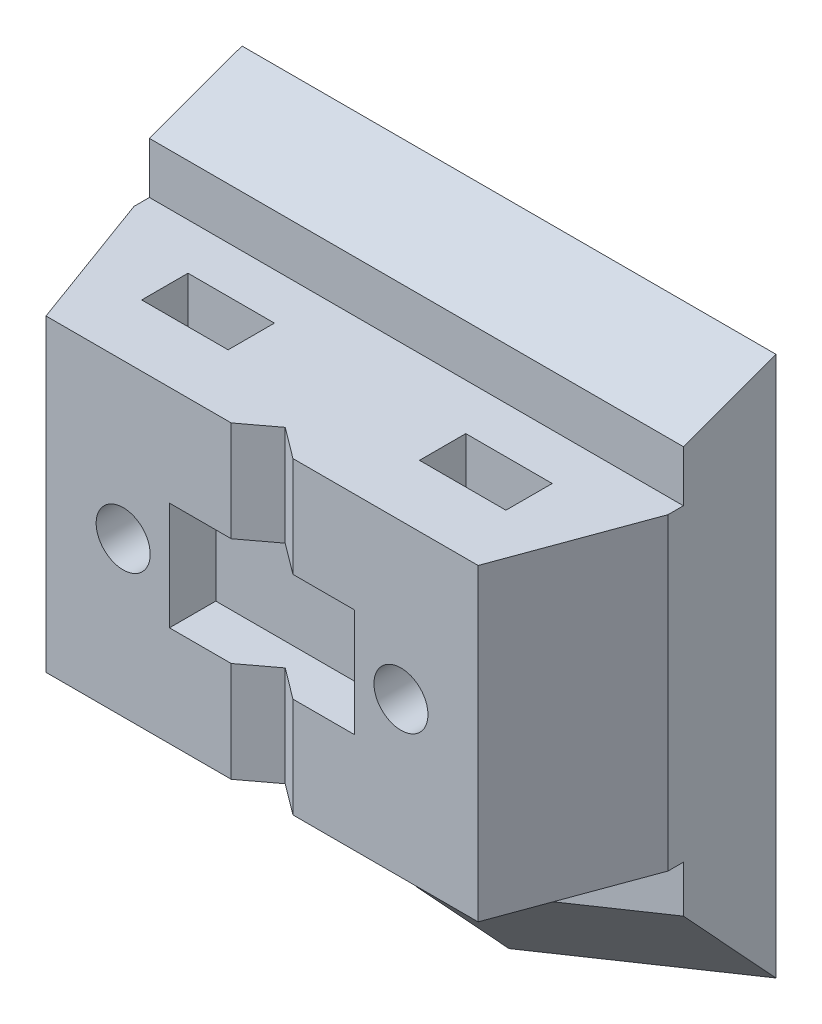
ISO-10303-21;
HEADER;
FILE_DESCRIPTION(('STEP AP214'),'2;1');
FILE_NAME('part.step','',(''),(''),'','','');
FILE_SCHEMA(('AUTOMOTIVE_DESIGN { 1 0 10303 214 1 1 1 1 }'));
ENDSEC;
DATA;
#1=APPLICATION_CONTEXT('core data for automotive mechanical design processes');
#2=APPLICATION_PROTOCOL_DEFINITION('international standard','automotive_design',2000,#1);
#3=PRODUCT_CONTEXT('',#1,'mechanical');
#4=PRODUCT('Part','Part','',(#3));
#5=PRODUCT_RELATED_PRODUCT_CATEGORY('part','',(#4));
#6=PRODUCT_DEFINITION_FORMATION('','',#4);
#7=PRODUCT_DEFINITION_CONTEXT('part definition',#1,'design');
#8=PRODUCT_DEFINITION('design','',#6,#7);
#9=PRODUCT_DEFINITION_SHAPE('','',#8);
#10=(LENGTH_UNIT() NAMED_UNIT(*) SI_UNIT(.MILLI.,.METRE.));
#11=(NAMED_UNIT(*) PLANE_ANGLE_UNIT() SI_UNIT($,.RADIAN.));
#12=(NAMED_UNIT(*) SI_UNIT($,.STERADIAN.) SOLID_ANGLE_UNIT());
#13=UNCERTAINTY_MEASURE_WITH_UNIT(LENGTH_MEASURE(1.E-05),#10,'distance_accuracy_value','');
#14=(GEOMETRIC_REPRESENTATION_CONTEXT(3) GLOBAL_UNCERTAINTY_ASSIGNED_CONTEXT((#13)) GLOBAL_UNIT_ASSIGNED_CONTEXT((#10,
#11,#12)) REPRESENTATION_CONTEXT('',''));
#15=CARTESIAN_POINT('',(0.,0.,0.));
#16=DIRECTION('',(0.,0.,1.));
#17=DIRECTION('',(1.,0.,0.));
#18=AXIS2_PLACEMENT_3D('',#15,#16,#17);
#19=CARTESIAN_POINT('',(-2.,10.,16.));
#20=DIRECTION('',(-0.6,0.,-0.8));
#21=DIRECTION('',(-0.8,0.,0.6));
#22=AXIS2_PLACEMENT_3D('',#19,#20,#21);
#23=PLANE('',#22);
#24=DIRECTION('',(0.,-1.,0.));
#25=VECTOR('',#24,1.);
#26=CARTESIAN_POINT('',(0.,10.,14.5));
#27=LINE('',#26,#25);
#28=CARTESIAN_POINT('',(0.,-3.5,14.5));
#29=VERTEX_POINT('',#28);
#30=CARTESIAN_POINT('',(0.,-10.,14.5));
#31=VERTEX_POINT('',#30);
#32=EDGE_CURVE('E423',#29,#31,#27,.T.);
#33=ORIENTED_EDGE('',*,*,#32,.F.);
#34=DIRECTION('',(-0.8,0.,0.6));
#35=VECTOR('',#34,1.);
#36=CARTESIAN_POINT('',(-2.,-3.5,16.));
#37=LINE('',#36,#35);
#38=CARTESIAN_POINT('',(-2.,-3.5,16.));
#39=VERTEX_POINT('',#38);
#40=EDGE_CURVE('E276',#29,#39,#37,.T.);
#41=ORIENTED_EDGE('',*,*,#40,.T.);
#42=DIRECTION('',(0.,-1.,0.));
#43=VECTOR('',#42,1.);
#44=CARTESIAN_POINT('',(-2.,10.,16.));
#45=LINE('',#44,#43);
#46=CARTESIAN_POINT('',(-2.,-10.,16.));
#47=VERTEX_POINT('',#46);
#48=EDGE_CURVE('E427',#39,#47,#45,.T.);
#49=ORIENTED_EDGE('',*,*,#48,.T.);
#50=DIRECTION('',(0.8,0.,-0.6));
#51=VECTOR('',#50,1.);
#52=CARTESIAN_POINT('',(-2.,-10.,16.));
#53=LINE('',#52,#51);
#54=EDGE_CURVE('E405',#47,#31,#53,.T.);
#55=ORIENTED_EDGE('',*,*,#54,.T.);
#56=EDGE_LOOP('',(#33,#41,#49,#55));
#57=FACE_BOUND('',#56,.T.);
#58=ADVANCED_FACE('F35',(#57),#23,.F.);
#59=CARTESIAN_POINT('',(0.,10.,14.5));
#60=DIRECTION('',(0.6,0.,-0.8));
#61=DIRECTION('',(-0.8,0.,-0.6));
#62=AXIS2_PLACEMENT_3D('',#59,#60,#61);
#63=PLANE('',#62);
#64=DIRECTION('',(0.,-1.,0.));
#65=VECTOR('',#64,1.);
#66=CARTESIAN_POINT('',(2.,10.,16.));
#67=LINE('',#66,#65);
#68=CARTESIAN_POINT('',(2.,-3.5,16.));
#69=VERTEX_POINT('',#68);
#70=CARTESIAN_POINT('',(2.,-10.,16.));
#71=VERTEX_POINT('',#70);
#72=EDGE_CURVE('E419',#69,#71,#67,.T.);
#73=ORIENTED_EDGE('',*,*,#72,.F.);
#74=DIRECTION('',(-0.8,0.,-0.6));
#75=VECTOR('',#74,1.);
#76=CARTESIAN_POINT('',(0.,-3.5,14.5));
#77=LINE('',#76,#75);
#78=EDGE_CURVE('E273',#69,#29,#77,.T.);
#79=ORIENTED_EDGE('',*,*,#78,.T.);
#80=ORIENTED_EDGE('',*,*,#32,.T.);
#81=DIRECTION('',(0.8,0.,0.6));
#82=VECTOR('',#81,1.);
#83=CARTESIAN_POINT('',(0.,-10.,14.5));
#84=LINE('',#83,#82);
#85=EDGE_CURVE('E408',#31,#71,#84,.T.);
#86=ORIENTED_EDGE('',*,*,#85,.T.);
#87=EDGE_LOOP('',(#73,#79,#80,#86));
#88=FACE_BOUND('',#87,.T.);
#89=ADVANCED_FACE('F523',(#88),#63,.F.);
#90=CARTESIAN_POINT('',(0.,-26.5,0.));
#91=DIRECTION('',(0.265223828337456,0.655481747176855,-0.707106781186549));
#92=DIRECTION('',(-0.926991176745522,0.375083135099344,0.));
#93=AXIS2_PLACEMENT_3D('',#90,#91,#92);
#94=PLANE('',#93);
#95=DIRECTION('',(0.,0.733371095333155,0.679828534654032));
#96=VECTOR('',#95,1.);
#97=CARTESIAN_POINT('',(0.,-26.5,0.));
#98=LINE('',#97,#96);
#99=CARTESIAN_POINT('',(0.,-20.0274464843724,6.));
#100=VERTEX_POINT('',#99);
#101=CARTESIAN_POINT('',(0.,-26.5,0.));
#102=VERTEX_POINT('',#101);
#103=EDGE_CURVE('E437',#100,#102,#98,.F.);
#104=ORIENTED_EDGE('',*,*,#103,.F.);
#105=DIRECTION('',(0.926991176745522,-0.375083135099344,0.));
#106=VECTOR('',#105,1.);
#107=CARTESIAN_POINT('',(2.25049881059607,-20.9380529395268,6.));
#108=LINE('',#107,#106);
#109=CARTESIAN_POINT('',(-17.3,-13.0274464843724,6.));
#110=VERTEX_POINT('',#109);
#111=EDGE_CURVE('E288',#100,#110,#108,.F.);
#112=ORIENTED_EDGE('',*,*,#111,.T.);
#113=DIRECTION('',(0.,-0.733371095333155,-0.679828534654032));
#114=VECTOR('',#113,1.);
#115=CARTESIAN_POINT('',(-17.3,-23.2648321442911,-3.48996617968573));
#116=LINE('',#115,#114);
#117=CARTESIAN_POINT('',(-17.3,-19.5,0.));
#118=VERTEX_POINT('',#117);
#119=EDGE_CURVE('E454',#118,#110,#116,.F.);
#120=ORIENTED_EDGE('',*,*,#119,.F.);
#121=DIRECTION('',(-0.926991176745522,0.375083135099344,0.));
#122=VECTOR('',#121,1.);
#123=CARTESIAN_POINT('',(0.,-26.5,0.));
#124=LINE('',#123,#122);
#125=EDGE_CURVE('E438',#102,#118,#124,.T.);
#126=ORIENTED_EDGE('',*,*,#125,.F.);
#127=EDGE_LOOP('',(#104,#112,#120,#126));
#128=FACE_BOUND('',#127,.T.);
#129=ADVANCED_FACE('F478',(#128),#94,.F.);
#130=CARTESIAN_POINT('',(17.3,-19.5,0.));
#131=DIRECTION('',(-0.265223828337456,0.655481747176855,-0.707106781186549));
#132=DIRECTION('',(-0.926991176745522,-0.375083135099344,0.));
#133=AXIS2_PLACEMENT_3D('',#130,#131,#132);
#134=PLANE('',#133);
#135=DIRECTION('',(0.,0.733371095333155,0.679828534654032));
#136=VECTOR('',#135,1.);
#137=CARTESIAN_POINT('',(17.3,-19.5,0.));
#138=LINE('',#137,#136);
#139=CARTESIAN_POINT('',(17.3,-13.0274464843724,6.));
#140=VERTEX_POINT('',#139);
#141=CARTESIAN_POINT('',(17.3,-19.5,0.));
#142=VERTEX_POINT('',#141);
#143=EDGE_CURVE('E452',#140,#142,#138,.F.);
#144=ORIENTED_EDGE('',*,*,#143,.F.);
#145=DIRECTION('',(0.926991176745522,0.375083135099344,0.));
#146=VECTOR('',#145,1.);
#147=CARTESIAN_POINT('',(15.0495011894039,-13.9380529395268,6.));
#148=LINE('',#147,#146);
#149=EDGE_CURVE('E43',#140,#100,#148,.F.);
#150=ORIENTED_EDGE('',*,*,#149,.T.);
#151=ORIENTED_EDGE('',*,*,#103,.T.);
#152=DIRECTION('',(-0.926991176745522,-0.375083135099344,0.));
#153=VECTOR('',#152,1.);
#154=CARTESIAN_POINT('',(17.3,-19.5,0.));
#155=LINE('',#154,#153);
#156=EDGE_CURVE('E442',#142,#102,#155,.T.);
#157=ORIENTED_EDGE('',*,*,#156,.F.);
#158=EDGE_LOOP('',(#144,#150,#151,#157));
#159=FACE_BOUND('',#158,.T.);
#160=ADVANCED_FACE('F472',(#159),#134,.F.);
#161=CARTESIAN_POINT('',(17.3,13.,7.));
#162=DIRECTION('',(-1.,0.,0.));
#163=DIRECTION('',(0.,0.,1.));
#164=AXIS2_PLACEMENT_3D('',#161,#162,#163);
#165=PLANE('',#164);
#166=DIRECTION('',(0.,-1.,0.));
#167=VECTOR('',#166,1.);
#168=CARTESIAN_POINT('',(17.3,10.,7.));
#169=LINE('',#168,#167);
#170=CARTESIAN_POINT('',(17.3,10.,7.));
#171=VERTEX_POINT('',#170);
#172=CARTESIAN_POINT('',(17.3,-9.99999999999999,7.));
#173=VERTEX_POINT('',#172);
#174=EDGE_CURVE('E400',#171,#173,#169,.T.);
#175=ORIENTED_EDGE('',*,*,#174,.T.);
#176=DIRECTION('',(0.,0.,1.));
#177=VECTOR('',#176,1.);
#178=CARTESIAN_POINT('',(17.3,-9.99999999999999,6.));
#179=LINE('',#178,#177);
#180=CARTESIAN_POINT('',(17.3,-9.99999999999999,6.));
#181=VERTEX_POINT('',#180);
#182=EDGE_CURVE('E58',#181,#173,#179,.T.);
#183=ORIENTED_EDGE('',*,*,#182,.F.);
#184=DIRECTION('',(0.,1.,0.));
#185=VECTOR('',#184,1.);
#186=CARTESIAN_POINT('',(17.3,-9.99999999999999,6.));
#187=LINE('',#186,#185);
#188=EDGE_CURVE('E281',#140,#181,#187,.T.);
#189=ORIENTED_EDGE('',*,*,#188,.F.);
#190=ORIENTED_EDGE('',*,*,#143,.T.);
#191=DIRECTION('',(0.,1.,0.));
#192=VECTOR('',#191,1.);
#193=CARTESIAN_POINT('',(17.3,13.,0.));
#194=LINE('',#193,#192);
#195=CARTESIAN_POINT('',(17.3,15.5,0.));
#196=VERTEX_POINT('',#195);
#197=EDGE_CURVE('E447',#142,#196,#194,.T.);
#198=ORIENTED_EDGE('',*,*,#197,.T.);
#199=DIRECTION('',(0.,0.342020143325666,-0.939692620785909));
#200=VECTOR('',#199,1.);
#201=CARTESIAN_POINT('',(17.3,15.5,0.));
#202=LINE('',#201,#200);
#203=CARTESIAN_POINT('',(17.3,13.3161785944028,6.));
#204=VERTEX_POINT('',#203);
#205=EDGE_CURVE('E457',#196,#204,#202,.F.);
#206=ORIENTED_EDGE('',*,*,#205,.T.);
#207=DIRECTION('',(0.,1.,0.));
#208=VECTOR('',#207,1.);
#209=CARTESIAN_POINT('',(17.3,10.,6.));
#210=LINE('',#209,#208);
#211=CARTESIAN_POINT('',(17.3,10.,6.));
#212=VERTEX_POINT('',#211);
#213=EDGE_CURVE('E297',#212,#204,#210,.T.);
#214=ORIENTED_EDGE('',*,*,#213,.F.);
#215=DIRECTION('',(0.,0.,1.));
#216=VECTOR('',#215,1.);
#217=CARTESIAN_POINT('',(17.3,10.,6.));
#218=LINE('',#217,#216);
#219=EDGE_CURVE('E300',#212,#171,#218,.T.);
#220=ORIENTED_EDGE('',*,*,#219,.T.);
#221=EDGE_LOOP('',(#175,#183,#189,#190,#198,#206,#214,#220));
#222=FACE_BOUND('',#221,.T.);
#223=ADVANCED_FACE('F486',(#222),#165,.F.);
#224=CARTESIAN_POINT('',(-17.3,13.,7.));
#225=DIRECTION('',(1.,0.,0.));
#226=DIRECTION('',(0.,1.,0.));
#227=AXIS2_PLACEMENT_3D('',#224,#225,#226);
#228=PLANE('',#227);
#229=DIRECTION('',(0.,-1.,0.));
#230=VECTOR('',#229,1.);
#231=CARTESIAN_POINT('',(-17.3,-9.99999999999999,6.));
#232=LINE('',#231,#230);
#233=CARTESIAN_POINT('',(-17.3,-9.99999999999999,6.));
#234=VERTEX_POINT('',#233);
#235=EDGE_CURVE('E279',#234,#110,#232,.T.);
#236=ORIENTED_EDGE('',*,*,#235,.F.);
#237=DIRECTION('',(0.,0.,1.));
#238=VECTOR('',#237,1.);
#239=CARTESIAN_POINT('',(-17.3,-9.99999999999999,6.));
#240=LINE('',#239,#238);
#241=CARTESIAN_POINT('',(-17.3,-9.99999999999999,7.));
#242=VERTEX_POINT('',#241);
#243=EDGE_CURVE('E286',#234,#242,#240,.T.);
#244=ORIENTED_EDGE('',*,*,#243,.T.);
#245=DIRECTION('',(0.,-1.,0.));
#246=VECTOR('',#245,1.);
#247=CARTESIAN_POINT('',(-17.3,10.,7.));
#248=LINE('',#247,#246);
#249=CARTESIAN_POINT('',(-17.3,10.,7.));
#250=VERTEX_POINT('',#249);
#251=EDGE_CURVE('E434',#250,#242,#248,.T.);
#252=ORIENTED_EDGE('',*,*,#251,.F.);
#253=DIRECTION('',(0.,0.,1.));
#254=VECTOR('',#253,1.);
#255=CARTESIAN_POINT('',(-17.3,10.,6.));
#256=LINE('',#255,#254);
#257=CARTESIAN_POINT('',(-17.3,10.,6.));
#258=VERTEX_POINT('',#257);
#259=EDGE_CURVE('E299',#258,#250,#256,.T.);
#260=ORIENTED_EDGE('',*,*,#259,.F.);
#261=DIRECTION('',(0.,-1.,0.));
#262=VECTOR('',#261,1.);
#263=CARTESIAN_POINT('',(-17.3,10.,6.));
#264=LINE('',#263,#262);
#265=CARTESIAN_POINT('',(-17.3,13.3161785944028,6.));
#266=VERTEX_POINT('',#265);
#267=EDGE_CURVE('E292',#266,#258,#264,.T.);
#268=ORIENTED_EDGE('',*,*,#267,.F.);
#269=DIRECTION('',(0.,-0.342020143325666,0.939692620785909));
#270=VECTOR('',#269,1.);
#271=CARTESIAN_POINT('',(-17.3,15.5,0.));
#272=LINE('',#271,#270);
#273=CARTESIAN_POINT('',(-17.3,15.5,0.));
#274=VERTEX_POINT('',#273);
#275=EDGE_CURVE('E461',#266,#274,#272,.F.);
#276=ORIENTED_EDGE('',*,*,#275,.T.);
#277=DIRECTION('',(0.,-1.,0.));
#278=VECTOR('',#277,1.);
#279=CARTESIAN_POINT('',(-17.3,13.,0.));
#280=LINE('',#279,#278);
#281=EDGE_CURVE('E450',#274,#118,#280,.T.);
#282=ORIENTED_EDGE('',*,*,#281,.T.);
#283=ORIENTED_EDGE('',*,*,#119,.T.);
#284=EDGE_LOOP('',(#236,#244,#252,#260,#268,#276,#282,#283));
#285=FACE_BOUND('',#284,.T.);
#286=ADVANCED_FACE('F496',(#285),#228,.F.);
#287=CARTESIAN_POINT('',(0.,0.,0.));
#288=DIRECTION('',(0.,0.,1.));
#289=DIRECTION('',(1.,0.,0.));
#290=AXIS2_PLACEMENT_3D('',#287,#288,#289);
#291=PLANE('',#290);
#292=CARTESIAN_POINT('',(9.,0.,0.));
#293=DIRECTION('',(0.,0.,1.));
#294=DIRECTION('',(1.,0.,0.));
#295=AXIS2_PLACEMENT_3D('',#292,#293,#294);
#296=CIRCLE('',#295,1.75);
#297=CARTESIAN_POINT('',(10.75,0.,0.));
#298=VERTEX_POINT('',#297);
#299=EDGE_CURVE('E310',#298,#298,#296,.T.);
#300=ORIENTED_EDGE('',*,*,#299,.T.);
#301=EDGE_LOOP('',(#300));
#302=FACE_BOUND('',#301,.T.);
#303=CARTESIAN_POINT('',(-9.,0.,0.));
#304=DIRECTION('',(0.,0.,1.));
#305=DIRECTION('',(1.,0.,0.));
#306=AXIS2_PLACEMENT_3D('',#303,#304,#305);
#307=CIRCLE('',#306,1.75);
#308=CARTESIAN_POINT('',(-7.25,0.,0.));
#309=VERTEX_POINT('',#308);
#310=EDGE_CURVE('E320',#309,#309,#307,.T.);
#311=ORIENTED_EDGE('',*,*,#310,.T.);
#312=EDGE_LOOP('',(#311));
#313=FACE_BOUND('',#312,.T.);
#314=ORIENTED_EDGE('',*,*,#197,.F.);
#315=ORIENTED_EDGE('',*,*,#156,.T.);
#316=ORIENTED_EDGE('',*,*,#125,.T.);
#317=ORIENTED_EDGE('',*,*,#281,.F.);
#318=DIRECTION('',(1.,0.,0.));
#319=VECTOR('',#318,1.);
#320=CARTESIAN_POINT('',(17.3,15.5,0.));
#321=LINE('',#320,#319);
#322=EDGE_CURVE('E441',#274,#196,#321,.T.);
#323=ORIENTED_EDGE('',*,*,#322,.T.);
#324=EDGE_LOOP('',(#314,#315,#316,#317,#323));
#325=FACE_BOUND('',#324,.T.);
#326=ADVANCED_FACE('F483',(#302,#313,#325),#291,.F.);
#327=CARTESIAN_POINT('',(17.3,15.5,0.));
#328=DIRECTION('',(0.,-0.939692620785909,-0.342020143325666));
#329=DIRECTION('',(1.,0.,0.));
#330=AXIS2_PLACEMENT_3D('',#327,#328,#329);
#331=PLANE('',#330);
#332=DIRECTION('',(1.,0.,0.));
#333=VECTOR('',#332,1.);
#334=CARTESIAN_POINT('',(17.3,13.3161785944028,6.));
#335=LINE('',#334,#333);
#336=EDGE_CURVE('E463',#204,#266,#335,.F.);
#337=ORIENTED_EDGE('',*,*,#336,.F.);
#338=ORIENTED_EDGE('',*,*,#205,.F.);
#339=ORIENTED_EDGE('',*,*,#322,.F.);
#340=ORIENTED_EDGE('',*,*,#275,.F.);
#341=EDGE_LOOP('',(#337,#338,#339,#340));
#342=FACE_BOUND('',#341,.T.);
#343=ADVANCED_FACE('F37',(#342),#331,.F.);
#344=CARTESIAN_POINT('',(0.,10.,0.));
#345=DIRECTION('',(0.,-1.,0.));
#346=DIRECTION('',(0.,0.,-1.));
#347=AXIS2_PLACEMENT_3D('',#344,#345,#346);
#348=PLANE('',#347);
#349=DIRECTION('',(0.,0.,-1.));
#350=VECTOR('',#349,1.);
#351=CARTESIAN_POINT('',(-6.2,10.,9.));
#352=LINE('',#351,#350);
#353=CARTESIAN_POINT('',(-6.2,10.,12.));
#354=VERTEX_POINT('',#353);
#355=CARTESIAN_POINT('',(-6.2,10.,9.));
#356=VERTEX_POINT('',#355);
#357=EDGE_CURVE('E355',#354,#356,#352,.T.);
#358=ORIENTED_EDGE('',*,*,#357,.F.);
#359=DIRECTION('',(1.,0.,0.));
#360=VECTOR('',#359,1.);
#361=CARTESIAN_POINT('',(-11.8,10.,12.));
#362=LINE('',#361,#360);
#363=CARTESIAN_POINT('',(-11.8,10.,12.));
#364=VERTEX_POINT('',#363);
#365=EDGE_CURVE('E363',#364,#354,#362,.T.);
#366=ORIENTED_EDGE('',*,*,#365,.F.);
#367=DIRECTION('',(0.,0.,1.));
#368=VECTOR('',#367,1.);
#369=CARTESIAN_POINT('',(-11.8,10.,9.));
#370=LINE('',#369,#368);
#371=CARTESIAN_POINT('',(-11.8,10.,9.));
#372=VERTEX_POINT('',#371);
#373=EDGE_CURVE('E360',#372,#364,#370,.T.);
#374=ORIENTED_EDGE('',*,*,#373,.F.);
#375=DIRECTION('',(-1.,0.,0.));
#376=VECTOR('',#375,1.);
#377=CARTESIAN_POINT('',(-11.8,10.,9.));
#378=LINE('',#377,#376);
#379=EDGE_CURVE('E357',#356,#372,#378,.T.);
#380=ORIENTED_EDGE('',*,*,#379,.F.);
#381=EDGE_LOOP('',(#358,#366,#374,#380));
#382=FACE_BOUND('',#381,.T.);
#383=DIRECTION('',(0.344254649158423,0.,-0.938876315886609));
#384=VECTOR('',#383,1.);
#385=CARTESIAN_POINT('',(17.3,10.,7.));
#386=LINE('',#385,#384);
#387=CARTESIAN_POINT('',(14.,10.,16.));
#388=VERTEX_POINT('',#387);
#389=EDGE_CURVE('E397',#388,#171,#386,.T.);
#390=ORIENTED_EDGE('',*,*,#389,.T.);
#391=ORIENTED_EDGE('',*,*,#219,.F.);
#392=DIRECTION('',(1.,0.,0.));
#393=VECTOR('',#392,1.);
#394=CARTESIAN_POINT('',(-17.3,10.,6.));
#395=LINE('',#394,#393);
#396=EDGE_CURVE('E294',#258,#212,#395,.T.);
#397=ORIENTED_EDGE('',*,*,#396,.F.);
#398=ORIENTED_EDGE('',*,*,#259,.T.);
#399=DIRECTION('',(0.344254649158423,0.,0.938876315886609));
#400=VECTOR('',#399,1.);
#401=CARTESIAN_POINT('',(-17.3,10.,7.));
#402=LINE('',#401,#400);
#403=CARTESIAN_POINT('',(-14.,10.,16.));
#404=VERTEX_POINT('',#403);
#405=EDGE_CURVE('E386',#250,#404,#402,.T.);
#406=ORIENTED_EDGE('',*,*,#405,.T.);
#407=DIRECTION('',(1.,0.,0.));
#408=VECTOR('',#407,1.);
#409=CARTESIAN_POINT('',(-14.,10.,16.));
#410=LINE('',#409,#408);
#411=CARTESIAN_POINT('',(-2.,10.,16.));
#412=VERTEX_POINT('',#411);
#413=EDGE_CURVE('E388',#404,#412,#410,.T.);
#414=ORIENTED_EDGE('',*,*,#413,.T.);
#415=DIRECTION('',(0.8,0.,-0.6));
#416=VECTOR('',#415,1.);
#417=CARTESIAN_POINT('',(-2.,10.,16.));
#418=LINE('',#417,#416);
#419=CARTESIAN_POINT('',(0.,10.,14.5));
#420=VERTEX_POINT('',#419);
#421=EDGE_CURVE('E391',#412,#420,#418,.T.);
#422=ORIENTED_EDGE('',*,*,#421,.T.);
#423=DIRECTION('',(0.8,0.,0.6));
#424=VECTOR('',#423,1.);
#425=CARTESIAN_POINT('',(0.,10.,14.5));
#426=LINE('',#425,#424);
#427=CARTESIAN_POINT('',(2.,10.,16.));
#428=VERTEX_POINT('',#427);
#429=EDGE_CURVE('E393',#420,#428,#426,.T.);
#430=ORIENTED_EDGE('',*,*,#429,.T.);
#431=DIRECTION('',(1.,0.,0.));
#432=VECTOR('',#431,1.);
#433=CARTESIAN_POINT('',(2.,10.,16.));
#434=LINE('',#433,#432);
#435=EDGE_CURVE('E395',#428,#388,#434,.T.);
#436=ORIENTED_EDGE('',*,*,#435,.T.);
#437=EDGE_LOOP('',(#390,#391,#397,#398,#406,#414,#422,#430,#436));
#438=FACE_BOUND('',#437,.T.);
#439=DIRECTION('',(0.,0.,-1.));
#440=VECTOR('',#439,1.);
#441=CARTESIAN_POINT('',(11.8,10.,9.));
#442=LINE('',#441,#440);
#443=CARTESIAN_POINT('',(11.8,10.,12.));
#444=VERTEX_POINT('',#443);
#445=CARTESIAN_POINT('',(11.8,10.,9.));
#446=VERTEX_POINT('',#445);
#447=EDGE_CURVE('E324',#444,#446,#442,.T.);
#448=ORIENTED_EDGE('',*,*,#447,.F.);
#449=DIRECTION('',(1.,0.,0.));
#450=VECTOR('',#449,1.);
#451=CARTESIAN_POINT('',(11.8,10.,12.));
#452=LINE('',#451,#450);
#453=CARTESIAN_POINT('',(6.2,10.,12.));
#454=VERTEX_POINT('',#453);
#455=EDGE_CURVE('E332',#454,#444,#452,.T.);
#456=ORIENTED_EDGE('',*,*,#455,.F.);
#457=DIRECTION('',(0.,0.,1.));
#458=VECTOR('',#457,1.);
#459=CARTESIAN_POINT('',(6.2,10.,9.));
#460=LINE('',#459,#458);
#461=CARTESIAN_POINT('',(6.2,10.,9.));
#462=VERTEX_POINT('',#461);
#463=EDGE_CURVE('E329',#462,#454,#460,.T.);
#464=ORIENTED_EDGE('',*,*,#463,.F.);
#465=DIRECTION('',(-1.,0.,0.));
#466=VECTOR('',#465,1.);
#467=CARTESIAN_POINT('',(11.8,10.,9.));
#468=LINE('',#467,#466);
#469=EDGE_CURVE('E326',#446,#462,#468,.T.);
#470=ORIENTED_EDGE('',*,*,#469,.F.);
#471=EDGE_LOOP('',(#448,#456,#464,#470));
#472=FACE_BOUND('',#471,.T.);
#473=ADVANCED_FACE('F507',(#382,#438,#472),#348,.F.);
#474=CARTESIAN_POINT('',(0.,-10.,0.));
#475=DIRECTION('',(0.,-1.,0.));
#476=DIRECTION('',(0.,0.,-1.));
#477=AXIS2_PLACEMENT_3D('',#474,#475,#476);
#478=PLANE('',#477);
#479=DIRECTION('',(0.344254649158423,0.,0.938876315886609));
#480=VECTOR('',#479,1.);
#481=CARTESIAN_POINT('',(-17.3,-10.,7.));
#482=LINE('',#481,#480);
#483=CARTESIAN_POINT('',(-14.,-10.,16.));
#484=VERTEX_POINT('',#483);
#485=EDGE_CURVE('E385',#242,#484,#482,.T.);
#486=ORIENTED_EDGE('',*,*,#485,.F.);
#487=ORIENTED_EDGE('',*,*,#243,.F.);
#488=DIRECTION('',(-1.,0.,0.));
#489=VECTOR('',#488,1.);
#490=CARTESIAN_POINT('',(-17.3,-9.99999999999999,6.));
#491=LINE('',#490,#489);
#492=EDGE_CURVE('E283',#181,#234,#491,.T.);
#493=ORIENTED_EDGE('',*,*,#492,.F.);
#494=ORIENTED_EDGE('',*,*,#182,.T.);
#495=DIRECTION('',(0.344254649158423,0.,-0.938876315886609));
#496=VECTOR('',#495,1.);
#497=CARTESIAN_POINT('',(17.3,-10.,7.));
#498=LINE('',#497,#496);
#499=CARTESIAN_POINT('',(14.,-10.,16.));
#500=VERTEX_POINT('',#499);
#501=EDGE_CURVE('E389',#500,#173,#498,.T.);
#502=ORIENTED_EDGE('',*,*,#501,.F.);
#503=DIRECTION('',(1.,0.,0.));
#504=VECTOR('',#503,1.);
#505=CARTESIAN_POINT('',(2.,-10.,16.));
#506=LINE('',#505,#504);
#507=EDGE_CURVE('E411',#71,#500,#506,.T.);
#508=ORIENTED_EDGE('',*,*,#507,.F.);
#509=ORIENTED_EDGE('',*,*,#85,.F.);
#510=ORIENTED_EDGE('',*,*,#54,.F.);
#511=DIRECTION('',(1.,0.,0.));
#512=VECTOR('',#511,1.);
#513=CARTESIAN_POINT('',(-14.,-10.,16.));
#514=LINE('',#513,#512);
#515=EDGE_CURVE('E402',#484,#47,#514,.T.);
#516=ORIENTED_EDGE('',*,*,#515,.F.);
#517=EDGE_LOOP('',(#486,#487,#493,#494,#502,#508,#509,#510,#516));
#518=FACE_BOUND('',#517,.T.);
#519=DIRECTION('',(1.,0.,0.));
#520=VECTOR('',#519,1.);
#521=CARTESIAN_POINT('',(-11.8,-10.,12.));
#522=LINE('',#521,#520);
#523=CARTESIAN_POINT('',(-11.8,-10.,12.));
#524=VERTEX_POINT('',#523);
#525=CARTESIAN_POINT('',(-6.2,-10.,12.));
#526=VERTEX_POINT('',#525);
#527=EDGE_CURVE('E358',#524,#526,#522,.T.);
#528=ORIENTED_EDGE('',*,*,#527,.T.);
#529=DIRECTION('',(0.,0.,-1.));
#530=VECTOR('',#529,1.);
#531=CARTESIAN_POINT('',(-6.2,-10.,9.));
#532=LINE('',#531,#530);
#533=CARTESIAN_POINT('',(-6.2,-10.,9.));
#534=VERTEX_POINT('',#533);
#535=EDGE_CURVE('E354',#526,#534,#532,.T.);
#536=ORIENTED_EDGE('',*,*,#535,.T.);
#537=DIRECTION('',(-1.,0.,0.));
#538=VECTOR('',#537,1.);
#539=CARTESIAN_POINT('',(-11.8,-10.,9.));
#540=LINE('',#539,#538);
#541=CARTESIAN_POINT('',(-11.8,-10.,9.));
#542=VERTEX_POINT('',#541);
#543=EDGE_CURVE('E368',#534,#542,#540,.T.);
#544=ORIENTED_EDGE('',*,*,#543,.T.);
#545=DIRECTION('',(0.,0.,1.));
#546=VECTOR('',#545,1.);
#547=CARTESIAN_POINT('',(-11.8,-10.,9.));
#548=LINE('',#547,#546);
#549=EDGE_CURVE('E371',#542,#524,#548,.T.);
#550=ORIENTED_EDGE('',*,*,#549,.T.);
#551=EDGE_LOOP('',(#528,#536,#544,#550));
#552=FACE_BOUND('',#551,.T.);
#553=DIRECTION('',(1.,0.,0.));
#554=VECTOR('',#553,1.);
#555=CARTESIAN_POINT('',(11.8,-10.,12.));
#556=LINE('',#555,#554);
#557=CARTESIAN_POINT('',(6.2,-10.,12.));
#558=VERTEX_POINT('',#557);
#559=CARTESIAN_POINT('',(11.8,-10.,12.));
#560=VERTEX_POINT('',#559);
#561=EDGE_CURVE('E327',#558,#560,#556,.T.);
#562=ORIENTED_EDGE('',*,*,#561,.T.);
#563=DIRECTION('',(0.,0.,-1.));
#564=VECTOR('',#563,1.);
#565=CARTESIAN_POINT('',(11.8,-10.,9.));
#566=LINE('',#565,#564);
#567=CARTESIAN_POINT('',(11.8,-10.,9.));
#568=VERTEX_POINT('',#567);
#569=EDGE_CURVE('E323',#560,#568,#566,.T.);
#570=ORIENTED_EDGE('',*,*,#569,.T.);
#571=DIRECTION('',(-1.,0.,0.));
#572=VECTOR('',#571,1.);
#573=CARTESIAN_POINT('',(11.8,-10.,9.));
#574=LINE('',#573,#572);
#575=CARTESIAN_POINT('',(6.2,-10.,9.));
#576=VERTEX_POINT('',#575);
#577=EDGE_CURVE('E337',#568,#576,#574,.T.);
#578=ORIENTED_EDGE('',*,*,#577,.T.);
#579=DIRECTION('',(0.,0.,1.));
#580=VECTOR('',#579,1.);
#581=CARTESIAN_POINT('',(6.2,-10.,9.));
#582=LINE('',#581,#580);
#583=EDGE_CURVE('E340',#576,#558,#582,.T.);
#584=ORIENTED_EDGE('',*,*,#583,.T.);
#585=EDGE_LOOP('',(#562,#570,#578,#584));
#586=FACE_BOUND('',#585,.T.);
#587=ADVANCED_FACE('F491',(#518,#552,#586),#478,.T.);
#588=CARTESIAN_POINT('',(-17.3,10.,7.));
#589=DIRECTION('',(0.938876315886609,0.,-0.344254649158423));
#590=DIRECTION('',(-0.344254649158423,0.,-0.938876315886609));
#591=AXIS2_PLACEMENT_3D('',#588,#589,#590);
#592=PLANE('',#591);
#593=ORIENTED_EDGE('',*,*,#485,.T.);
#594=DIRECTION('',(0.,-1.,0.));
#595=VECTOR('',#594,1.);
#596=CARTESIAN_POINT('',(-14.,10.,16.));
#597=LINE('',#596,#595);
#598=EDGE_CURVE('E431',#404,#484,#597,.T.);
#599=ORIENTED_EDGE('',*,*,#598,.F.);
#600=ORIENTED_EDGE('',*,*,#405,.F.);
#601=ORIENTED_EDGE('',*,*,#251,.T.);
#602=EDGE_LOOP('',(#593,#599,#600,#601));
#603=FACE_BOUND('',#602,.T.);
#604=ADVANCED_FACE('F533',(#603),#592,.F.);
#605=CARTESIAN_POINT('',(-14.,10.,16.));
#606=DIRECTION('',(0.,0.,-1.));
#607=DIRECTION('',(-1.,0.,0.));
#608=AXIS2_PLACEMENT_3D('',#605,#606,#607);
#609=PLANE('',#608);
#610=CARTESIAN_POINT('',(-9.,0.,16.));
#611=DIRECTION('',(0.,0.,1.));
#612=DIRECTION('',(1.,0.,0.));
#613=AXIS2_PLACEMENT_3D('',#610,#611,#612);
#614=CIRCLE('',#613,1.75);
#615=CARTESIAN_POINT('',(-7.25,0.,16.));
#616=VERTEX_POINT('',#615);
#617=EDGE_CURVE('E313',#616,#616,#614,.T.);
#618=ORIENTED_EDGE('',*,*,#617,.F.);
#619=EDGE_LOOP('',(#618));
#620=FACE_BOUND('',#619,.T.);
#621=ORIENTED_EDGE('',*,*,#48,.F.);
#622=DIRECTION('',(1.,0.,0.));
#623=VECTOR('',#622,1.);
#624=CARTESIAN_POINT('',(-6.,-3.5,16.));
#625=LINE('',#624,#623);
#626=CARTESIAN_POINT('',(-6.,-3.5,16.));
#627=VERTEX_POINT('',#626);
#628=EDGE_CURVE('E249',#627,#39,#625,.T.);
#629=ORIENTED_EDGE('',*,*,#628,.F.);
#630=DIRECTION('',(0.,-1.,0.));
#631=VECTOR('',#630,1.);
#632=CARTESIAN_POINT('',(-6.,3.5,16.));
#633=LINE('',#632,#631);
#634=CARTESIAN_POINT('',(-6.,3.5,16.));
#635=VERTEX_POINT('',#634);
#636=EDGE_CURVE('E251',#635,#627,#633,.T.);
#637=ORIENTED_EDGE('',*,*,#636,.F.);
#638=DIRECTION('',(-1.,0.,0.));
#639=VECTOR('',#638,1.);
#640=CARTESIAN_POINT('',(-6.,3.5,16.));
#641=LINE('',#640,#639);
#642=CARTESIAN_POINT('',(-2.,3.5,16.));
#643=VERTEX_POINT('',#642);
#644=EDGE_CURVE('E257',#643,#635,#641,.T.);
#645=ORIENTED_EDGE('',*,*,#644,.F.);
#646=EDGE_CURVE('E428',#412,#643,#45,.T.);
#647=ORIENTED_EDGE('',*,*,#646,.F.);
#648=ORIENTED_EDGE('',*,*,#413,.F.);
#649=ORIENTED_EDGE('',*,*,#598,.T.);
#650=ORIENTED_EDGE('',*,*,#515,.T.);
#651=EDGE_LOOP('',(#621,#629,#637,#645,#647,#648,#649,#650));
#652=FACE_BOUND('',#651,.T.);
#653=ADVANCED_FACE('F528',(#620,#652),#609,.F.);
#654=ORIENTED_EDGE('',*,*,#646,.T.);
#655=DIRECTION('',(0.8,0.,-0.6));
#656=VECTOR('',#655,1.);
#657=CARTESIAN_POINT('',(-2.,3.5,16.));
#658=LINE('',#657,#656);
#659=CARTESIAN_POINT('',(0.,3.5,14.5));
#660=VERTEX_POINT('',#659);
#661=EDGE_CURVE('E270',#643,#660,#658,.T.);
#662=ORIENTED_EDGE('',*,*,#661,.T.);
#663=EDGE_CURVE('E424',#420,#660,#27,.T.);
#664=ORIENTED_EDGE('',*,*,#663,.F.);
#665=ORIENTED_EDGE('',*,*,#421,.F.);
#666=EDGE_LOOP('',(#654,#662,#664,#665));
#667=FACE_BOUND('',#666,.T.);
#668=ADVANCED_FACE('F540',(#667),#23,.F.);
#669=ORIENTED_EDGE('',*,*,#663,.T.);
#670=DIRECTION('',(0.8,0.,0.6));
#671=VECTOR('',#670,1.);
#672=CARTESIAN_POINT('',(0.,3.5,14.5));
#673=LINE('',#672,#671);
#674=CARTESIAN_POINT('',(2.,3.5,16.));
#675=VERTEX_POINT('',#674);
#676=EDGE_CURVE('E264',#660,#675,#673,.T.);
#677=ORIENTED_EDGE('',*,*,#676,.T.);
#678=EDGE_CURVE('E420',#428,#675,#67,.T.);
#679=ORIENTED_EDGE('',*,*,#678,.F.);
#680=ORIENTED_EDGE('',*,*,#429,.F.);
#681=EDGE_LOOP('',(#669,#677,#679,#680));
#682=FACE_BOUND('',#681,.T.);
#683=ADVANCED_FACE('F551',(#682),#63,.F.);
#684=CARTESIAN_POINT('',(2.,10.,16.));
#685=DIRECTION('',(0.,0.,-1.));
#686=DIRECTION('',(-1.,0.,0.));
#687=AXIS2_PLACEMENT_3D('',#684,#685,#686);
#688=PLANE('',#687);
#689=CARTESIAN_POINT('',(9.,0.,16.));
#690=DIRECTION('',(0.,0.,1.));
#691=DIRECTION('',(-1.,0.,0.));
#692=AXIS2_PLACEMENT_3D('',#689,#690,#691);
#693=CIRCLE('',#692,1.75);
#694=CARTESIAN_POINT('',(7.25,0.,16.));
#695=VERTEX_POINT('',#694);
#696=EDGE_CURVE('E302',#695,#695,#693,.T.);
#697=ORIENTED_EDGE('',*,*,#696,.F.);
#698=EDGE_LOOP('',(#697));
#699=FACE_BOUND('',#698,.T.);
#700=DIRECTION('',(0.,1.,0.));
#701=VECTOR('',#700,1.);
#702=CARTESIAN_POINT('',(6.,3.5,16.));
#703=LINE('',#702,#701);
#704=CARTESIAN_POINT('',(6.,-3.5,16.));
#705=VERTEX_POINT('',#704);
#706=CARTESIAN_POINT('',(6.,3.5,16.));
#707=VERTEX_POINT('',#706);
#708=EDGE_CURVE('E50',#705,#707,#703,.T.);
#709=ORIENTED_EDGE('',*,*,#708,.F.);
#710=DIRECTION('',(-1.,0.,0.));
#711=VECTOR('',#710,1.);
#712=CARTESIAN_POINT('',(2.,-3.5,16.));
#713=LINE('',#712,#711);
#714=EDGE_CURVE('E11',#705,#69,#713,.T.);
#715=ORIENTED_EDGE('',*,*,#714,.T.);
#716=ORIENTED_EDGE('',*,*,#72,.T.);
#717=ORIENTED_EDGE('',*,*,#507,.T.);
#718=DIRECTION('',(0.,-1.,0.));
#719=VECTOR('',#718,1.);
#720=CARTESIAN_POINT('',(14.,10.,16.));
#721=LINE('',#720,#719);
#722=EDGE_CURVE('E416',#388,#500,#721,.T.);
#723=ORIENTED_EDGE('',*,*,#722,.F.);
#724=ORIENTED_EDGE('',*,*,#435,.F.);
#725=ORIENTED_EDGE('',*,*,#678,.T.);
#726=EDGE_CURVE('E258',#707,#675,#641,.T.);
#727=ORIENTED_EDGE('',*,*,#726,.F.);
#728=EDGE_LOOP('',(#709,#715,#716,#717,#723,#724,#725,#727));
#729=FACE_BOUND('',#728,.T.);
#730=ADVANCED_FACE('F520',(#699,#729),#688,.F.);
#731=CARTESIAN_POINT('',(17.3,10.,7.));
#732=DIRECTION('',(-0.938876315886609,0.,-0.344254649158423));
#733=DIRECTION('',(-0.344254649158423,0.,0.938876315886609));
#734=AXIS2_PLACEMENT_3D('',#731,#732,#733);
#735=PLANE('',#734);
#736=ORIENTED_EDGE('',*,*,#501,.T.);
#737=ORIENTED_EDGE('',*,*,#174,.F.);
#738=ORIENTED_EDGE('',*,*,#389,.F.);
#739=ORIENTED_EDGE('',*,*,#722,.T.);
#740=EDGE_LOOP('',(#736,#737,#738,#739));
#741=FACE_BOUND('',#740,.T.);
#742=ADVANCED_FACE('F515',(#741),#735,.F.);
#743=CARTESIAN_POINT('',(-6.2,10.,9.));
#744=DIRECTION('',(-1.,0.,0.));
#745=DIRECTION('',(0.,0.,1.));
#746=AXIS2_PLACEMENT_3D('',#743,#744,#745);
#747=PLANE('',#746);
#748=ORIENTED_EDGE('',*,*,#535,.F.);
#749=DIRECTION('',(0.,-1.,0.));
#750=VECTOR('',#749,1.);
#751=CARTESIAN_POINT('',(-6.2,10.,12.));
#752=LINE('',#751,#750);
#753=EDGE_CURVE('E365',#354,#526,#752,.T.);
#754=ORIENTED_EDGE('',*,*,#753,.F.);
#755=ORIENTED_EDGE('',*,*,#357,.T.);
#756=DIRECTION('',(0.,-1.,0.));
#757=VECTOR('',#756,1.);
#758=CARTESIAN_POINT('',(-6.2,10.,9.));
#759=LINE('',#758,#757);
#760=EDGE_CURVE('E382',#356,#534,#759,.T.);
#761=ORIENTED_EDGE('',*,*,#760,.T.);
#762=EDGE_LOOP('',(#748,#754,#755,#761));
#763=FACE_BOUND('',#762,.T.);
#764=ADVANCED_FACE('F621',(#763),#747,.T.);
#765=CARTESIAN_POINT('',(-11.8,10.,9.));
#766=DIRECTION('',(0.,0.,1.));
#767=DIRECTION('',(1.,0.,0.));
#768=AXIS2_PLACEMENT_3D('',#765,#766,#767);
#769=PLANE('',#768);
#770=CARTESIAN_POINT('',(-9.,0.,9.));
#771=DIRECTION('',(0.,0.,1.));
#772=DIRECTION('',(1.,0.,0.));
#773=AXIS2_PLACEMENT_3D('',#770,#771,#772);
#774=CIRCLE('',#773,1.75);
#775=CARTESIAN_POINT('',(-7.25,0.,9.));
#776=VERTEX_POINT('',#775);
#777=EDGE_CURVE('E317',#776,#776,#774,.T.);
#778=ORIENTED_EDGE('',*,*,#777,.F.);
#779=EDGE_LOOP('',(#778));
#780=FACE_BOUND('',#779,.T.);
#781=ORIENTED_EDGE('',*,*,#543,.F.);
#782=ORIENTED_EDGE('',*,*,#760,.F.);
#783=ORIENTED_EDGE('',*,*,#379,.T.);
#784=DIRECTION('',(0.,-1.,0.));
#785=VECTOR('',#784,1.);
#786=CARTESIAN_POINT('',(-11.8,10.,9.));
#787=LINE('',#786,#785);
#788=EDGE_CURVE('E380',#372,#542,#787,.T.);
#789=ORIENTED_EDGE('',*,*,#788,.T.);
#790=EDGE_LOOP('',(#781,#782,#783,#789));
#791=FACE_BOUND('',#790,.T.);
#792=ADVANCED_FACE('F617',(#780,#791),#769,.T.);
#793=CARTESIAN_POINT('',(-11.8,10.,9.));
#794=DIRECTION('',(1.,0.,0.));
#795=DIRECTION('',(0.,0.,-1.));
#796=AXIS2_PLACEMENT_3D('',#793,#794,#795);
#797=PLANE('',#796);
#798=ORIENTED_EDGE('',*,*,#549,.F.);
#799=ORIENTED_EDGE('',*,*,#788,.F.);
#800=ORIENTED_EDGE('',*,*,#373,.T.);
#801=DIRECTION('',(0.,-1.,0.));
#802=VECTOR('',#801,1.);
#803=CARTESIAN_POINT('',(-11.8,10.,12.));
#804=LINE('',#803,#802);
#805=EDGE_CURVE('E378',#364,#524,#804,.T.);
#806=ORIENTED_EDGE('',*,*,#805,.T.);
#807=EDGE_LOOP('',(#798,#799,#800,#806));
#808=FACE_BOUND('',#807,.T.);
#809=ADVANCED_FACE('F613',(#808),#797,.T.);
#810=CARTESIAN_POINT('',(-11.8,10.,12.));
#811=DIRECTION('',(0.,0.,-1.));
#812=DIRECTION('',(-1.,0.,0.));
#813=AXIS2_PLACEMENT_3D('',#810,#811,#812);
#814=PLANE('',#813);
#815=CARTESIAN_POINT('',(-9.,0.,12.));
#816=DIRECTION('',(0.,0.,-1.));
#817=DIRECTION('',(-1.,0.,0.));
#818=AXIS2_PLACEMENT_3D('',#815,#816,#817);
#819=CIRCLE('',#818,1.75);
#820=CARTESIAN_POINT('',(-10.75,0.,12.));
#821=VERTEX_POINT('',#820);
#822=EDGE_CURVE('E316',#821,#821,#819,.T.);
#823=ORIENTED_EDGE('',*,*,#822,.F.);
#824=EDGE_LOOP('',(#823));
#825=FACE_BOUND('',#824,.T.);
#826=ORIENTED_EDGE('',*,*,#527,.F.);
#827=ORIENTED_EDGE('',*,*,#805,.F.);
#828=ORIENTED_EDGE('',*,*,#365,.T.);
#829=ORIENTED_EDGE('',*,*,#753,.T.);
#830=EDGE_LOOP('',(#826,#827,#828,#829));
#831=FACE_BOUND('',#830,.T.);
#832=ADVANCED_FACE('F609',(#825,#831),#814,.T.);
#833=CARTESIAN_POINT('',(11.8,10.,9.));
#834=DIRECTION('',(-1.,0.,0.));
#835=DIRECTION('',(0.,0.,1.));
#836=AXIS2_PLACEMENT_3D('',#833,#834,#835);
#837=PLANE('',#836);
#838=ORIENTED_EDGE('',*,*,#569,.F.);
#839=DIRECTION('',(0.,-1.,0.));
#840=VECTOR('',#839,1.);
#841=CARTESIAN_POINT('',(11.8,10.,12.));
#842=LINE('',#841,#840);
#843=EDGE_CURVE('E334',#444,#560,#842,.T.);
#844=ORIENTED_EDGE('',*,*,#843,.F.);
#845=ORIENTED_EDGE('',*,*,#447,.T.);
#846=DIRECTION('',(0.,-1.,0.));
#847=VECTOR('',#846,1.);
#848=CARTESIAN_POINT('',(11.8,10.,9.));
#849=LINE('',#848,#847);
#850=EDGE_CURVE('E351',#446,#568,#849,.T.);
#851=ORIENTED_EDGE('',*,*,#850,.T.);
#852=EDGE_LOOP('',(#838,#844,#845,#851));
#853=FACE_BOUND('',#852,.T.);
#854=ADVANCED_FACE('F605',(#853),#837,.T.);
#855=CARTESIAN_POINT('',(11.8,10.,9.));
#856=DIRECTION('',(0.,0.,1.));
#857=DIRECTION('',(1.,0.,0.));
#858=AXIS2_PLACEMENT_3D('',#855,#856,#857);
#859=PLANE('',#858);
#860=CARTESIAN_POINT('',(9.,0.,9.));
#861=DIRECTION('',(0.,0.,1.));
#862=DIRECTION('',(1.,0.,0.));
#863=AXIS2_PLACEMENT_3D('',#860,#861,#862);
#864=CIRCLE('',#863,1.75);
#865=CARTESIAN_POINT('',(10.75,0.,9.));
#866=VERTEX_POINT('',#865);
#867=EDGE_CURVE('E307',#866,#866,#864,.T.);
#868=ORIENTED_EDGE('',*,*,#867,.F.);
#869=EDGE_LOOP('',(#868));
#870=FACE_BOUND('',#869,.T.);
#871=ORIENTED_EDGE('',*,*,#577,.F.);
#872=ORIENTED_EDGE('',*,*,#850,.F.);
#873=ORIENTED_EDGE('',*,*,#469,.T.);
#874=DIRECTION('',(0.,-1.,0.));
#875=VECTOR('',#874,1.);
#876=CARTESIAN_POINT('',(6.2,10.,9.));
#877=LINE('',#876,#875);
#878=EDGE_CURVE('E349',#462,#576,#877,.T.);
#879=ORIENTED_EDGE('',*,*,#878,.T.);
#880=EDGE_LOOP('',(#871,#872,#873,#879));
#881=FACE_BOUND('',#880,.T.);
#882=ADVANCED_FACE('F601',(#870,#881),#859,.T.);
#883=CARTESIAN_POINT('',(6.2,10.,9.));
#884=DIRECTION('',(1.,0.,0.));
#885=DIRECTION('',(0.,0.,-1.));
#886=AXIS2_PLACEMENT_3D('',#883,#884,#885);
#887=PLANE('',#886);
#888=ORIENTED_EDGE('',*,*,#583,.F.);
#889=ORIENTED_EDGE('',*,*,#878,.F.);
#890=ORIENTED_EDGE('',*,*,#463,.T.);
#891=DIRECTION('',(0.,-1.,0.));
#892=VECTOR('',#891,1.);
#893=CARTESIAN_POINT('',(6.2,10.,12.));
#894=LINE('',#893,#892);
#895=EDGE_CURVE('E347',#454,#558,#894,.T.);
#896=ORIENTED_EDGE('',*,*,#895,.T.);
#897=EDGE_LOOP('',(#888,#889,#890,#896));
#898=FACE_BOUND('',#897,.T.);
#899=ADVANCED_FACE('F597',(#898),#887,.T.);
#900=CARTESIAN_POINT('',(11.8,10.,12.));
#901=DIRECTION('',(0.,0.,-1.));
#902=DIRECTION('',(-1.,0.,0.));
#903=AXIS2_PLACEMENT_3D('',#900,#901,#902);
#904=PLANE('',#903);
#905=CARTESIAN_POINT('',(9.,0.,12.));
#906=DIRECTION('',(0.,0.,-1.));
#907=DIRECTION('',(-1.,0.,0.));
#908=AXIS2_PLACEMENT_3D('',#905,#906,#907);
#909=CIRCLE('',#908,1.75);
#910=CARTESIAN_POINT('',(7.25,0.,12.));
#911=VERTEX_POINT('',#910);
#912=EDGE_CURVE('E306',#911,#911,#909,.T.);
#913=ORIENTED_EDGE('',*,*,#912,.F.);
#914=EDGE_LOOP('',(#913));
#915=FACE_BOUND('',#914,.T.);
#916=ORIENTED_EDGE('',*,*,#561,.F.);
#917=ORIENTED_EDGE('',*,*,#895,.F.);
#918=ORIENTED_EDGE('',*,*,#455,.T.);
#919=ORIENTED_EDGE('',*,*,#843,.T.);
#920=EDGE_LOOP('',(#916,#917,#918,#919));
#921=FACE_BOUND('',#920,.T.);
#922=ADVANCED_FACE('F593',(#915,#921),#904,.T.);
#923=CARTESIAN_POINT('',(-9.,0.,-4.));
#924=DIRECTION('',(0.,0.,1.));
#925=DIRECTION('',(1.,0.,0.));
#926=AXIS2_PLACEMENT_3D('',#923,#924,#925);
#927=CYLINDRICAL_SURFACE('',#926,1.75);
#928=ORIENTED_EDGE('',*,*,#822,.T.);
#929=EDGE_LOOP('',(#928));
#930=FACE_BOUND('',#929,.T.);
#931=ORIENTED_EDGE('',*,*,#617,.T.);
#932=EDGE_LOOP('',(#931));
#933=FACE_BOUND('',#932,.T.);
#934=ADVANCED_FACE('F590',(#930,#933),#927,.F.);
#935=ORIENTED_EDGE('',*,*,#777,.T.);
#936=EDGE_LOOP('',(#935));
#937=FACE_BOUND('',#936,.T.);
#938=ORIENTED_EDGE('',*,*,#310,.F.);
#939=EDGE_LOOP('',(#938));
#940=FACE_BOUND('',#939,.T.);
#941=ADVANCED_FACE('F588',(#937,#940),#927,.F.);
#942=CARTESIAN_POINT('',(9.,0.,-4.));
#943=DIRECTION('',(0.,0.,1.));
#944=DIRECTION('',(1.,0.,0.));
#945=AXIS2_PLACEMENT_3D('',#942,#943,#944);
#946=CYLINDRICAL_SURFACE('',#945,1.75);
#947=ORIENTED_EDGE('',*,*,#912,.T.);
#948=EDGE_LOOP('',(#947));
#949=FACE_BOUND('',#948,.T.);
#950=ORIENTED_EDGE('',*,*,#696,.T.);
#951=EDGE_LOOP('',(#950));
#952=FACE_BOUND('',#951,.T.);
#953=ADVANCED_FACE('F585',(#949,#952),#946,.F.);
#954=ORIENTED_EDGE('',*,*,#867,.T.);
#955=EDGE_LOOP('',(#954));
#956=FACE_BOUND('',#955,.T.);
#957=ORIENTED_EDGE('',*,*,#299,.F.);
#958=EDGE_LOOP('',(#957));
#959=FACE_BOUND('',#958,.T.);
#960=ADVANCED_FACE('F584',(#956,#959),#946,.F.);
#961=CARTESIAN_POINT('',(0.,0.,6.));
#962=DIRECTION('',(0.,0.,-1.));
#963=DIRECTION('',(-1.,0.,0.));
#964=AXIS2_PLACEMENT_3D('',#961,#962,#963);
#965=PLANE('',#964);
#966=ORIENTED_EDGE('',*,*,#336,.T.);
#967=ORIENTED_EDGE('',*,*,#267,.T.);
#968=ORIENTED_EDGE('',*,*,#396,.T.);
#969=ORIENTED_EDGE('',*,*,#213,.T.);
#970=EDGE_LOOP('',(#966,#967,#968,#969));
#971=FACE_BOUND('',#970,.T.);
#972=ADVANCED_FACE('F504',(#971),#965,.F.);
#973=CARTESIAN_POINT('',(0.,0.,6.));
#974=DIRECTION('',(0.,0.,1.));
#975=DIRECTION('',(1.,0.,0.));
#976=AXIS2_PLACEMENT_3D('',#973,#974,#975);
#977=PLANE('',#976);
#978=ORIENTED_EDGE('',*,*,#149,.F.);
#979=ORIENTED_EDGE('',*,*,#188,.T.);
#980=ORIENTED_EDGE('',*,*,#492,.T.);
#981=ORIENTED_EDGE('',*,*,#235,.T.);
#982=ORIENTED_EDGE('',*,*,#111,.F.);
#983=EDGE_LOOP('',(#978,#979,#980,#981,#982));
#984=FACE_BOUND('',#983,.T.);
#985=ADVANCED_FACE('F488',(#984),#977,.T.);
#986=CARTESIAN_POINT('',(-6.,-3.5,13.));
#987=DIRECTION('',(0.,-1.,0.));
#988=DIRECTION('',(0.,0.,-1.));
#989=AXIS2_PLACEMENT_3D('',#986,#987,#988);
#990=PLANE('',#989);
#991=ORIENTED_EDGE('',*,*,#78,.F.);
#992=ORIENTED_EDGE('',*,*,#714,.F.);
#993=DIRECTION('',(0.,0.,1.));
#994=VECTOR('',#993,1.);
#995=CARTESIAN_POINT('',(6.,-3.5,13.));
#996=LINE('',#995,#994);
#997=CARTESIAN_POINT('',(6.,-3.5,13.));
#998=VERTEX_POINT('',#997);
#999=EDGE_CURVE('E262',#998,#705,#996,.T.);
#1000=ORIENTED_EDGE('',*,*,#999,.F.);
#1001=DIRECTION('',(1.,0.,0.));
#1002=VECTOR('',#1001,1.);
#1003=CARTESIAN_POINT('',(-6.,-3.5,13.));
#1004=LINE('',#1003,#1002);
#1005=CARTESIAN_POINT('',(-6.,-3.5,13.));
#1006=VERTEX_POINT('',#1005);
#1007=EDGE_CURVE('E236',#1006,#998,#1004,.T.);
#1008=ORIENTED_EDGE('',*,*,#1007,.F.);
#1009=DIRECTION('',(0.,0.,1.));
#1010=VECTOR('',#1009,1.);
#1011=CARTESIAN_POINT('',(-6.,-3.5,13.));
#1012=LINE('',#1011,#1010);
#1013=EDGE_CURVE('E265',#1006,#627,#1012,.T.);
#1014=ORIENTED_EDGE('',*,*,#1013,.T.);
#1015=ORIENTED_EDGE('',*,*,#628,.T.);
#1016=ORIENTED_EDGE('',*,*,#40,.F.);
#1017=EDGE_LOOP('',(#991,#992,#1000,#1008,#1014,#1015,#1016));
#1018=FACE_BOUND('',#1017,.T.);
#1019=ADVANCED_FACE('F565',(#1018),#990,.F.);
#1020=CARTESIAN_POINT('',(-6.,3.5,13.));
#1021=DIRECTION('',(0.,1.,0.));
#1022=DIRECTION('',(0.,0.,1.));
#1023=AXIS2_PLACEMENT_3D('',#1020,#1021,#1022);
#1024=PLANE('',#1023);
#1025=ORIENTED_EDGE('',*,*,#644,.T.);
#1026=DIRECTION('',(0.,0.,1.));
#1027=VECTOR('',#1026,1.);
#1028=CARTESIAN_POINT('',(-6.,3.5,13.));
#1029=LINE('',#1028,#1027);
#1030=CARTESIAN_POINT('',(-6.,3.5,13.));
#1031=VERTEX_POINT('',#1030);
#1032=EDGE_CURVE('E235',#1031,#635,#1029,.T.);
#1033=ORIENTED_EDGE('',*,*,#1032,.F.);
#1034=DIRECTION('',(-1.,0.,0.));
#1035=VECTOR('',#1034,1.);
#1036=CARTESIAN_POINT('',(-6.,3.5,13.));
#1037=LINE('',#1036,#1035);
#1038=CARTESIAN_POINT('',(6.,3.5,13.));
#1039=VERTEX_POINT('',#1038);
#1040=EDGE_CURVE('E239',#1039,#1031,#1037,.T.);
#1041=ORIENTED_EDGE('',*,*,#1040,.F.);
#1042=DIRECTION('',(0.,0.,1.));
#1043=VECTOR('',#1042,1.);
#1044=CARTESIAN_POINT('',(6.,3.5,13.));
#1045=LINE('',#1044,#1043);
#1046=EDGE_CURVE('E227',#1039,#707,#1045,.T.);
#1047=ORIENTED_EDGE('',*,*,#1046,.T.);
#1048=ORIENTED_EDGE('',*,*,#726,.T.);
#1049=ORIENTED_EDGE('',*,*,#676,.F.);
#1050=ORIENTED_EDGE('',*,*,#661,.F.);
#1051=EDGE_LOOP('',(#1025,#1033,#1041,#1047,#1048,#1049,#1050));
#1052=FACE_BOUND('',#1051,.T.);
#1053=ADVANCED_FACE('F240',(#1052),#1024,.F.);
#1054=CARTESIAN_POINT('',(6.,3.5,13.));
#1055=DIRECTION('',(1.,0.,0.));
#1056=DIRECTION('',(0.,1.,0.));
#1057=AXIS2_PLACEMENT_3D('',#1054,#1055,#1056);
#1058=PLANE('',#1057);
#1059=ORIENTED_EDGE('',*,*,#708,.T.);
#1060=ORIENTED_EDGE('',*,*,#1046,.F.);
#1061=DIRECTION('',(0.,1.,0.));
#1062=VECTOR('',#1061,1.);
#1063=CARTESIAN_POINT('',(6.,3.5,13.));
#1064=LINE('',#1063,#1062);
#1065=EDGE_CURVE('E231',#998,#1039,#1064,.T.);
#1066=ORIENTED_EDGE('',*,*,#1065,.F.);
#1067=ORIENTED_EDGE('',*,*,#999,.T.);
#1068=EDGE_LOOP('',(#1059,#1060,#1066,#1067));
#1069=FACE_BOUND('',#1068,.T.);
#1070=ADVANCED_FACE('F229',(#1069),#1058,.F.);
#1071=CARTESIAN_POINT('',(-6.,3.5,13.));
#1072=DIRECTION('',(-1.,0.,0.));
#1073=DIRECTION('',(0.,-1.,0.));
#1074=AXIS2_PLACEMENT_3D('',#1071,#1072,#1073);
#1075=PLANE('',#1074);
#1076=ORIENTED_EDGE('',*,*,#636,.T.);
#1077=ORIENTED_EDGE('',*,*,#1013,.F.);
#1078=DIRECTION('',(0.,-1.,0.));
#1079=VECTOR('',#1078,1.);
#1080=CARTESIAN_POINT('',(-6.,3.5,13.));
#1081=LINE('',#1080,#1079);
#1082=EDGE_CURVE('E245',#1031,#1006,#1081,.T.);
#1083=ORIENTED_EDGE('',*,*,#1082,.F.);
#1084=ORIENTED_EDGE('',*,*,#1032,.T.);
#1085=EDGE_LOOP('',(#1076,#1077,#1083,#1084));
#1086=FACE_BOUND('',#1085,.T.);
#1087=ADVANCED_FACE('F563',(#1086),#1075,.F.);
#1088=CARTESIAN_POINT('',(0.,0.,13.));
#1089=DIRECTION('',(0.,0.,1.));
#1090=DIRECTION('',(1.,0.,0.));
#1091=AXIS2_PLACEMENT_3D('',#1088,#1089,#1090);
#1092=PLANE('',#1091);
#1093=ORIENTED_EDGE('',*,*,#1065,.T.);
#1094=ORIENTED_EDGE('',*,*,#1040,.T.);
#1095=ORIENTED_EDGE('',*,*,#1082,.T.);
#1096=ORIENTED_EDGE('',*,*,#1007,.T.);
#1097=EDGE_LOOP('',(#1093,#1094,#1095,#1096));
#1098=FACE_BOUND('',#1097,.T.);
#1099=ADVANCED_FACE('F247',(#1098),#1092,.T.);
#1100=CLOSED_SHELL('',(#58,#89,#129,#160,#223,#286,#326,#343,#473,#587,#604,#653,#668,#683,#730,
#742,#764,#792,#809,#832,#854,#882,#899,#922,#934,#941,#953,#960,#972,#985,#1019,#1053,#1070,
#1087,#1099));
#1101=MANIFOLD_SOLID_BREP('B2',#1100);
#1102=ADVANCED_BREP_SHAPE_REPRESENTATION('',(#18,#1101),#14);
#1103=SHAPE_DEFINITION_REPRESENTATION(#9,#1102);
ENDSEC;
END-ISO-10303-21;
